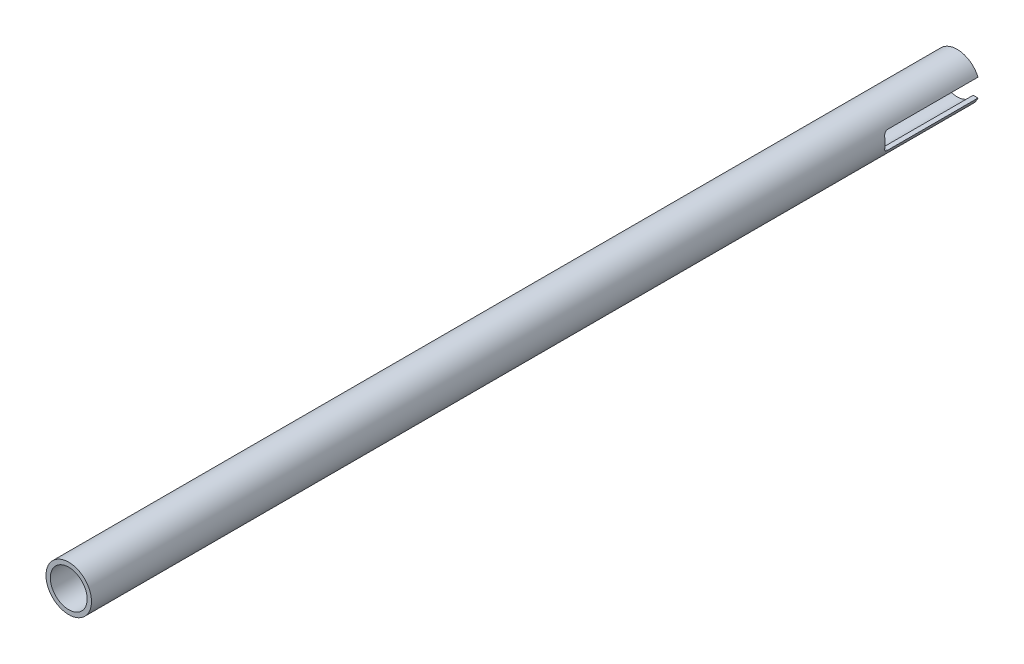
ISO-10303-21;
HEADER;
FILE_DESCRIPTION(('STEP AP214'),'2;1');
FILE_NAME('part.step','',(''),(''),'','','');
FILE_SCHEMA(('AUTOMOTIVE_DESIGN { 1 0 10303 214 1 1 1 1 }'));
ENDSEC;
DATA;
#1=APPLICATION_CONTEXT('core data for automotive mechanical design processes');
#2=APPLICATION_PROTOCOL_DEFINITION('international standard','automotive_design',2000,#1);
#3=PRODUCT_CONTEXT('',#1,'mechanical');
#4=PRODUCT('Part','Part','',(#3));
#5=PRODUCT_RELATED_PRODUCT_CATEGORY('part','',(#4));
#6=PRODUCT_DEFINITION_FORMATION('','',#4);
#7=PRODUCT_DEFINITION_CONTEXT('part definition',#1,'design');
#8=PRODUCT_DEFINITION('design','',#6,#7);
#9=PRODUCT_DEFINITION_SHAPE('','',#8);
#10=(LENGTH_UNIT() NAMED_UNIT(*) SI_UNIT(.MILLI.,.METRE.));
#11=(NAMED_UNIT(*) PLANE_ANGLE_UNIT() SI_UNIT($,.RADIAN.));
#12=(NAMED_UNIT(*) SI_UNIT($,.STERADIAN.) SOLID_ANGLE_UNIT());
#13=UNCERTAINTY_MEASURE_WITH_UNIT(LENGTH_MEASURE(1.E-05),#10,'distance_accuracy_value','');
#14=(GEOMETRIC_REPRESENTATION_CONTEXT(3) GLOBAL_UNCERTAINTY_ASSIGNED_CONTEXT((#13)) GLOBAL_UNIT_ASSIGNED_CONTEXT((#10,
#11,#12)) REPRESENTATION_CONTEXT('',''));
#15=CARTESIAN_POINT('',(0.,0.,0.));
#16=DIRECTION('',(0.,0.,1.));
#17=DIRECTION('',(1.,0.,0.));
#18=AXIS2_PLACEMENT_3D('',#15,#16,#17);
#19=CARTESIAN_POINT('',(0.,0.,0.));
#20=DIRECTION('',(0.,0.,1.));
#21=DIRECTION('',(1.,0.,0.));
#22=AXIS2_PLACEMENT_3D('',#19,#20,#21);
#23=PLANE('',#22);
#24=DIRECTION('',(-1.,0.,0.));
#25=VECTOR('',#24,1.);
#26=CARTESIAN_POINT('',(401.549427926421,-3.17500000000001,0.));
#27=LINE('',#26,#25);
#28=CARTESIAN_POINT('',(7.34407080575888,-3.17500000000001,0.));
#29=VERTEX_POINT('',#28);
#30=CARTESIAN_POINT('',(5.6454321358068,-3.17499999999999,0.));
#31=VERTEX_POINT('',#30);
#32=EDGE_CURVE('E57',#29,#31,#27,.T.);
#33=ORIENTED_EDGE('',*,*,#32,.F.);
#34=CARTESIAN_POINT('',(0.,0.,0.));
#35=DIRECTION('',(0.,0.,1.));
#36=DIRECTION('',(1.,0.,0.));
#37=AXIS2_PLACEMENT_3D('',#34,#35,#36);
#38=CIRCLE('',#37,8.001);
#39=CARTESIAN_POINT('',(-7.34407080575888,-3.17500000000001,0.));
#40=VERTEX_POINT('',#39);
#41=EDGE_CURVE('E146',#40,#29,#38,.T.);
#42=ORIENTED_EDGE('',*,*,#41,.F.);
#43=CARTESIAN_POINT('',(-5.64543213580682,-3.17500000000001,0.));
#44=VERTEX_POINT('',#43);
#45=EDGE_CURVE('E140',#44,#40,#27,.T.);
#46=ORIENTED_EDGE('',*,*,#45,.F.);
#47=CARTESIAN_POINT('',(0.,0.,0.));
#48=DIRECTION('',(0.,0.,1.));
#49=DIRECTION('',(1.,0.,0.));
#50=AXIS2_PLACEMENT_3D('',#47,#48,#49);
#51=CIRCLE('',#50,6.477);
#52=EDGE_CURVE('E242',#44,#31,#51,.T.);
#53=ORIENTED_EDGE('',*,*,#52,.T.);
#54=EDGE_LOOP('',(#33,#42,#46,#53));
#55=FACE_BOUND('',#54,.T.);
#56=ADVANCED_FACE('F33',(#55),#23,.F.);
#57=CARTESIAN_POINT('',(0.,0.,312.42));
#58=DIRECTION('',(0.,0.,-1.));
#59=DIRECTION('',(-1.,0.,0.));
#60=AXIS2_PLACEMENT_3D('',#57,#58,#59);
#61=CYLINDRICAL_SURFACE('',#60,8.001);
#62=CARTESIAN_POINT('',(0.,0.,312.42));
#63=DIRECTION('',(0.,0.,1.));
#64=DIRECTION('',(1.,0.,0.));
#65=AXIS2_PLACEMENT_3D('',#62,#63,#64);
#66=CIRCLE('',#65,8.001);
#67=CARTESIAN_POINT('',(8.001,0.,312.42));
#68=VERTEX_POINT('',#67);
#69=EDGE_CURVE('E249',#68,#68,#66,.T.);
#70=ORIENTED_EDGE('',*,*,#69,.F.);
#71=EDGE_LOOP('',(#70));
#72=FACE_BOUND('',#71,.T.);
#73=DIRECTION('',(0.,0.,-1.));
#74=VECTOR('',#73,1.);
#75=CARTESIAN_POINT('',(7.34407080575893,3.17499999999991,312.42));
#76=LINE('',#75,#74);
#77=CARTESIAN_POINT('',(7.34407080575894,3.175,0.));
#78=VERTEX_POINT('',#77);
#79=CARTESIAN_POINT('',(7.34407080575889,3.17499999999999,31.75));
#80=VERTEX_POINT('',#79);
#81=EDGE_CURVE('E238',#78,#80,#76,.F.);
#82=ORIENTED_EDGE('',*,*,#81,.F.);
#83=CARTESIAN_POINT('',(-7.34407080575894,3.175,0.));
#84=VERTEX_POINT('',#83);
#85=EDGE_CURVE('E253',#78,#84,#38,.T.);
#86=ORIENTED_EDGE('',*,*,#85,.T.);
#87=DIRECTION('',(0.,0.,-1.));
#88=VECTOR('',#87,1.);
#89=CARTESIAN_POINT('',(-7.34407080575893,3.17499999999991,312.42));
#90=LINE('',#89,#88);
#91=CARTESIAN_POINT('',(-7.34407080575889,3.17499999999999,31.75));
#92=VERTEX_POINT('',#91);
#93=EDGE_CURVE('E240',#92,#84,#90,.T.);
#94=ORIENTED_EDGE('',*,*,#93,.F.);
#95=CARTESIAN_POINT('',(-7.8288057837706,1.65099999999999,33.274));
#96=CARTESIAN_POINT('',(-7.81947795268345,1.69524181564514,33.2739996807889));
#97=CARTESIAN_POINT('',(-7.80977555287386,1.73937906238703,33.2720725755956));
#98=CARTESIAN_POINT('',(-7.7897053190962,1.82715995012294,33.2644259194222));
#99=CARTESIAN_POINT('',(-7.77933765259943,1.870803712116,33.2587073195399));
#100=CARTESIAN_POINT('',(-7.74740781787862,2.00038689143379,33.2359920832168));
#101=CARTESIAN_POINT('',(-7.72497172734663,2.08520038066885,33.2134353611242));
#102=CARTESIAN_POINT('',(-7.67879255624773,2.24931803273243,33.1543529357356));
#103=CARTESIAN_POINT('',(-7.65505009243317,2.32862475603218,33.117833776622));
#104=CARTESIAN_POINT('',(-7.60739952527334,2.47987144136614,33.0318403935313));
#105=CARTESIAN_POINT('',(-7.58349136309819,2.55180862700726,32.9823613118312));
#106=CARTESIAN_POINT('',(-7.53640113822511,2.68773877112478,32.8705553900397));
#107=CARTESIAN_POINT('',(-7.51324222932276,2.75155008701076,32.8079974672164));
#108=CARTESIAN_POINT('',(-7.46969556535498,2.86766507697724,32.6721080561482));
#109=CARTESIAN_POINT('',(-7.44930787514765,2.91996848174228,32.5987763158346));
#110=CARTESIAN_POINT('',(-7.41339882631975,3.00995182097469,32.445356056821));
#111=CARTESIAN_POINT('',(-7.39775949227146,3.04799299625043,32.365507568052));
#112=CARTESIAN_POINT('',(-7.37198636942666,3.10981595853761,32.1996963126839));
#113=CARTESIAN_POINT('',(-7.36184321814924,3.13362200161646,32.1137442276388));
#114=CARTESIAN_POINT('',(-7.35134082404798,3.15814271182933,31.980748149592));
#115=CARTESIAN_POINT('',(-7.34862226710174,3.16445643648463,31.9348527548858));
#116=CARTESIAN_POINT('',(-7.34498545577234,3.17288497032065,31.8426477775769));
#117=CARTESIAN_POINT('',(-7.34406565426136,3.17500338794749,31.7963385853611));
#118=CARTESIAN_POINT('',(-7.34407080575889,3.17499999999999,31.75));
#119=B_SPLINE_CURVE_WITH_KNOTS('',3,(#95,#96,#97,#98,#99,#100,#101,#102,#103,#104,#105,#106,
#107,#108,#109,#110,#111,#112,#113,#114,#115,#116,#117,#118),.UNSPECIFIED.,.F.,.F.,(4,2,2,2,2,2,
2,2,2,2,2,4),(0.,0.135553024626245,0.271072058592375,0.541437670457962,0.811676717226676,
1.08201720207601,1.35761362878683,1.63321650449497,1.90127196271359,2.16886935439238,
2.3078905012207,2.44679202186551),.UNSPECIFIED.);
#120=CARTESIAN_POINT('',(-7.8288057837706,1.65099999999999,33.274));
#121=VERTEX_POINT('',#120);
#122=EDGE_CURVE('E226',#121,#92,#119,.T.);
#123=ORIENTED_EDGE('',*,*,#122,.F.);
#124=CARTESIAN_POINT('',(0.,0.,33.274));
#125=DIRECTION('',(0.,0.,-1.));
#126=DIRECTION('',(-1.,0.,0.));
#127=AXIS2_PLACEMENT_3D('',#124,#125,#126);
#128=CIRCLE('',#127,8.001);
#129=CARTESIAN_POINT('',(-7.8288057837706,-1.65100000000001,33.274));
#130=VERTEX_POINT('',#129);
#131=EDGE_CURVE('E134',#130,#121,#128,.T.);
#132=ORIENTED_EDGE('',*,*,#131,.F.);
#133=CARTESIAN_POINT('',(-7.34407080575888,-3.175,31.75));
#134=CARTESIAN_POINT('',(-7.3440680096913,-3.17500157818638,31.7906984476088));
#135=CARTESIAN_POINT('',(-7.34477630214677,-3.17336860893187,31.8313759502433));
#136=CARTESIAN_POINT('',(-7.34758309143993,-3.16686635956913,31.912411407968));
#137=CARTESIAN_POINT('',(-7.34968118035477,-3.16199802907896,31.9527694533067));
#138=CARTESIAN_POINT('',(-7.35798857580184,-3.14264423927033,32.0726338560667));
#139=CARTESIAN_POINT('',(-7.36621159330718,-3.12340930879257,32.1512906881812));
#140=CARTESIAN_POINT('',(-7.38735918413182,-3.07305366060584,32.3038993996992));
#141=CARTESIAN_POINT('',(-7.40028060607282,-3.04194090905529,32.377854393813));
#142=CARTESIAN_POINT('',(-7.4298815779994,-2.96890708335138,32.5194453435949));
#143=CARTESIAN_POINT('',(-7.44656372650464,-2.92697853298673,32.5870768840646));
#144=CARTESIAN_POINT('',(-7.48338951433548,-2.83153727514408,32.7173193992745));
#145=CARTESIAN_POINT('',(-7.5036517696014,-2.77760154335605,32.7795861247467));
#146=CARTESIAN_POINT('',(-7.54586923311684,-2.66077336101833,32.8943978381578));
#147=CARTESIAN_POINT('',(-7.56782510086072,-2.59787741319581,32.9469390116058));
#148=CARTESIAN_POINT('',(-7.61377353576087,-2.46009532987571,33.04442490565));
#149=CARTESIAN_POINT('',(-7.63780327629239,-2.38468542927396,33.088613263246));
#150=CARTESIAN_POINT('',(-7.68517828309943,-2.22728162943213,33.1635295949975));
#151=CARTESIAN_POINT('',(-7.70852388215322,-2.14529100625114,33.1942642181981));
#152=CARTESIAN_POINT('',(-7.74866065435345,-1.99473307846589,33.2363269168587));
#153=CARTESIAN_POINT('',(-7.76579152458538,-1.9270088220366,33.2503889784846));
#154=CARTESIAN_POINT('',(-7.79853598216448,-1.78994063052703,33.2692336722557));
#155=CARTESIAN_POINT('',(-7.81414985826825,-1.7205970068191,33.2740180736839));
#156=CARTESIAN_POINT('',(-7.8288057837706,-1.65100000000001,33.274));
#157=B_SPLINE_CURVE_WITH_KNOTS('',3,(#133,#134,#135,#136,#137,#138,#139,#140,#141,#142,#143,
#144,#145,#146,#147,#148,#149,#150,#151,#152,#153,#154,#155,#156),.UNSPECIFIED.,.F.,.F.,(4,2,2,
2,2,2,2,2,2,2,2,4),(0.,0.122015614312961,0.243995431359561,0.486888996424005,0.729619944201783,
0.972519126749106,1.22593711832599,1.47945429417213,1.75015649231413,2.02072475374974,
2.23388433321154,2.44700325838136),.UNSPECIFIED.);
#158=CARTESIAN_POINT('',(-7.34407080575888,-3.175,31.75));
#159=VERTEX_POINT('',#158);
#160=EDGE_CURVE('E135',#159,#130,#157,.T.);
#161=ORIENTED_EDGE('',*,*,#160,.F.);
#162=DIRECTION('',(0.,0.,-1.));
#163=VECTOR('',#162,1.);
#164=CARTESIAN_POINT('',(-7.34407080575889,-3.17499999999999,312.42));
#165=LINE('',#164,#163);
#166=EDGE_CURVE('E147',#40,#159,#165,.F.);
#167=ORIENTED_EDGE('',*,*,#166,.F.);
#168=ORIENTED_EDGE('',*,*,#41,.T.);
#169=DIRECTION('',(0.,0.,-1.));
#170=VECTOR('',#169,1.);
#171=CARTESIAN_POINT('',(7.34407080575889,-3.17499999999999,312.42));
#172=LINE('',#171,#170);
#173=CARTESIAN_POINT('',(7.34407080575888,-3.175,31.75));
#174=VERTEX_POINT('',#173);
#175=EDGE_CURVE('E138',#174,#29,#172,.T.);
#176=ORIENTED_EDGE('',*,*,#175,.F.);
#177=CARTESIAN_POINT('',(7.8288057837706,-1.65100000000001,33.274));
#178=CARTESIAN_POINT('',(7.81947795268344,-1.69524181564516,33.2739996807889));
#179=CARTESIAN_POINT('',(7.80977555287386,-1.73937906238705,33.2720725755956));
#180=CARTESIAN_POINT('',(7.78970531909619,-1.82715995012295,33.2644259194222));
#181=CARTESIAN_POINT('',(7.77933765259943,-1.87080371211602,33.2587073195399));
#182=CARTESIAN_POINT('',(7.74740781787862,-2.00038689143381,33.2359920832168));
#183=CARTESIAN_POINT('',(7.72497172734662,-2.08520038066886,33.2134353611242));
#184=CARTESIAN_POINT('',(7.67879255624773,-2.24931803273245,33.1543529357356));
#185=CARTESIAN_POINT('',(7.65505009243317,-2.3286247560322,33.117833776622));
#186=CARTESIAN_POINT('',(7.60739952527334,-2.47987144136616,33.0318403935313));
#187=CARTESIAN_POINT('',(7.58349136309819,-2.55180862700728,32.9823613118312));
#188=CARTESIAN_POINT('',(7.5364011382251,-2.6877387711248,32.8705553900397));
#189=CARTESIAN_POINT('',(7.51324222932275,-2.75155008701078,32.8079974672164));
#190=CARTESIAN_POINT('',(7.46969556535497,-2.86766507697726,32.6721080561482));
#191=CARTESIAN_POINT('',(7.44930787514765,-2.9199684817423,32.5987763158346));
#192=CARTESIAN_POINT('',(7.41339882631974,-3.00995182097471,32.445356056821));
#193=CARTESIAN_POINT('',(7.39775949227145,-3.04799299625045,32.365507568052));
#194=CARTESIAN_POINT('',(7.37198636942665,-3.10981595853762,32.1996963126839));
#195=CARTESIAN_POINT('',(7.36184321814923,-3.13362200161647,32.1137442276388));
#196=CARTESIAN_POINT('',(7.35134082404797,-3.15814271182935,31.980748149592));
#197=CARTESIAN_POINT('',(7.34862226710173,-3.16445643648464,31.9348527548858));
#198=CARTESIAN_POINT('',(7.34498545577233,-3.17288497032067,31.8426477775769));
#199=CARTESIAN_POINT('',(7.34406565426135,-3.17500338794751,31.7963385853611));
#200=CARTESIAN_POINT('',(7.34407080575888,-3.175,31.75));
#201=B_SPLINE_CURVE_WITH_KNOTS('',3,(#177,#178,#179,#180,#181,#182,#183,#184,#185,#186,#187,
#188,#189,#190,#191,#192,#193,#194,#195,#196,#197,#198,#199,#200),.UNSPECIFIED.,.F.,.F.,(4,2,2,
2,2,2,2,2,2,2,2,4),(0.,0.135553024626244,0.271072058592371,0.541437670457961,0.811676717226673,
1.082017202076,1.35761362878683,1.63321650449497,1.90127196271358,2.16886935439238,
2.3078905012207,2.4467920218655),.UNSPECIFIED.);
#202=CARTESIAN_POINT('',(7.8288057837706,-1.65100000000001,33.274));
#203=VERTEX_POINT('',#202);
#204=EDGE_CURVE('E124',#203,#174,#201,.T.);
#205=ORIENTED_EDGE('',*,*,#204,.F.);
#206=CARTESIAN_POINT('',(7.8288057837706,1.65099999999999,33.274));
#207=VERTEX_POINT('',#206);
#208=EDGE_CURVE('E232',#207,#203,#128,.T.);
#209=ORIENTED_EDGE('',*,*,#208,.F.);
#210=CARTESIAN_POINT('',(7.34407080575889,3.17499999999999,31.75));
#211=CARTESIAN_POINT('',(7.34406800969131,3.17500157818637,31.7906984476088));
#212=CARTESIAN_POINT('',(7.34477630214678,3.17336860893185,31.8313759502433));
#213=CARTESIAN_POINT('',(7.34758309143993,3.16686635956911,31.912411407968));
#214=CARTESIAN_POINT('',(7.34968118035478,3.16199802907894,31.9527694533067));
#215=CARTESIAN_POINT('',(7.35798857580184,3.14264423927031,32.0726338560667));
#216=CARTESIAN_POINT('',(7.36621159330719,3.12340930879255,32.1512906881812));
#217=CARTESIAN_POINT('',(7.38735918413183,3.07305366060582,32.3038993996992));
#218=CARTESIAN_POINT('',(7.40028060607282,3.04194090905527,32.377854393813));
#219=CARTESIAN_POINT('',(7.42988157799941,2.96890708335136,32.5194453435949));
#220=CARTESIAN_POINT('',(7.44656372650465,2.92697853298671,32.5870768840646));
#221=CARTESIAN_POINT('',(7.48338951433549,2.83153727514406,32.7173193992745));
#222=CARTESIAN_POINT('',(7.50365176960141,2.77760154335604,32.7795861247467));
#223=CARTESIAN_POINT('',(7.54586923311685,2.66077336101832,32.8943978381578));
#224=CARTESIAN_POINT('',(7.56782510086072,2.59787741319579,32.9469390116058));
#225=CARTESIAN_POINT('',(7.61377353576087,2.4600953298757,33.04442490565));
#226=CARTESIAN_POINT('',(7.6378032762924,2.38468542927394,33.088613263246));
#227=CARTESIAN_POINT('',(7.68517828309944,2.22728162943211,33.1635295949975));
#228=CARTESIAN_POINT('',(7.70852388215323,2.14529100625112,33.1942642181981));
#229=CARTESIAN_POINT('',(7.74866065435345,1.99473307846586,33.2363269168587));
#230=CARTESIAN_POINT('',(7.76579152458538,1.92700882203658,33.2503889784846));
#231=CARTESIAN_POINT('',(7.79853598216448,1.78994063052701,33.2692336722557));
#232=CARTESIAN_POINT('',(7.81414985826825,1.72059700681908,33.2740180736839));
#233=CARTESIAN_POINT('',(7.8288057837706,1.65099999999999,33.274));
#234=B_SPLINE_CURVE_WITH_KNOTS('',3,(#210,#211,#212,#213,#214,#215,#216,#217,#218,#219,#220,
#221,#222,#223,#224,#225,#226,#227,#228,#229,#230,#231,#232,#233),.UNSPECIFIED.,.F.,.F.,(4,2,2,
2,2,2,2,2,2,2,2,4),(0.,0.122015614312961,0.243995431359561,0.486888996424005,0.729619944201783,
0.972519126749114,1.22593711832599,1.47945429417213,1.75015649231414,2.02072475374975,
2.23388433321155,2.44700325838137),.UNSPECIFIED.);
#235=EDGE_CURVE('E231',#80,#207,#234,.T.);
#236=ORIENTED_EDGE('',*,*,#235,.F.);
#237=EDGE_LOOP('',(#82,#86,#94,#123,#132,#161,#167,#168,#176,#205,#209,#236));
#238=FACE_BOUND('',#237,.T.);
#239=ADVANCED_FACE('F35',(#72,#238),#61,.T.);
#240=CARTESIAN_POINT('',(0.,0.,312.42));
#241=DIRECTION('',(0.,0.,-1.));
#242=DIRECTION('',(-1.,0.,0.));
#243=AXIS2_PLACEMENT_3D('',#240,#241,#242);
#244=CYLINDRICAL_SURFACE('',#243,6.477);
#245=CARTESIAN_POINT('',(0.,0.,312.42));
#246=DIRECTION('',(0.,0.,1.));
#247=DIRECTION('',(1.,0.,0.));
#248=AXIS2_PLACEMENT_3D('',#245,#246,#247);
#249=CIRCLE('',#248,6.477);
#250=CARTESIAN_POINT('',(6.477,0.,312.42));
#251=VERTEX_POINT('',#250);
#252=EDGE_CURVE('E243',#251,#251,#249,.T.);
#253=ORIENTED_EDGE('',*,*,#252,.T.);
#254=EDGE_LOOP('',(#253));
#255=FACE_BOUND('',#254,.T.);
#256=CARTESIAN_POINT('',(5.64543213580682,3.175,0.));
#257=VERTEX_POINT('',#256);
#258=CARTESIAN_POINT('',(-5.64543213580682,3.175,0.));
#259=VERTEX_POINT('',#258);
#260=EDGE_CURVE('E246',#257,#259,#51,.T.);
#261=ORIENTED_EDGE('',*,*,#260,.F.);
#262=DIRECTION('',(0.,0.,-1.));
#263=VECTOR('',#262,1.);
#264=CARTESIAN_POINT('',(5.64543213580684,3.17499999999991,312.42));
#265=LINE('',#264,#263);
#266=CARTESIAN_POINT('',(5.64543213580679,3.17499999999999,31.75));
#267=VERTEX_POINT('',#266);
#268=EDGE_CURVE('E11',#257,#267,#265,.F.);
#269=ORIENTED_EDGE('',*,*,#268,.T.);
#270=CARTESIAN_POINT('',(5.6454321358068,3.17499999999999,31.75));
#271=CARTESIAN_POINT('',(5.64542798532432,3.1750025301249,31.7895022750384));
#272=CARTESIAN_POINT('',(5.64629676751123,3.17346305780188,31.8289831851797));
#273=CARTESIAN_POINT('',(5.64973489172762,3.16734010596933,31.907616333837));
#274=CARTESIAN_POINT('',(5.65230347216193,3.16275798971433,31.9467687115998));
#275=CARTESIAN_POINT('',(5.66245282356231,3.14457608288718,32.0629070155873));
#276=CARTESIAN_POINT('',(5.67247830845162,3.1265396508718,32.1390381879893));
#277=CARTESIAN_POINT('',(5.69814957474155,3.07950075965754,32.2866255007952));
#278=CARTESIAN_POINT('',(5.71378770060105,3.05051323473277,32.3580878532046));
#279=CARTESIAN_POINT('',(5.74949312759986,2.98267072120713,32.4950337996201));
#280=CARTESIAN_POINT('',(5.7695654342793,2.94380457356395,32.5605105176722));
#281=CARTESIAN_POINT('',(5.81427344287328,2.85454020484128,32.6883725064171));
#282=CARTESIAN_POINT('',(5.83912294015509,2.80355001313473,32.7502682413202));
#283=CARTESIAN_POINT('',(5.89090094280743,2.69305400468479,32.8649190340714));
#284=CARTESIAN_POINT('',(5.91783040535228,2.63354425646504,32.9176698468731));
#285=CARTESIAN_POINT('',(5.9754026920417,2.50037980782341,33.0183991647787));
#286=CARTESIAN_POINT('',(6.00613015030678,2.42589024924425,33.0652294493506));
#287=CARTESIAN_POINT('',(6.06685054178971,2.26977298542591,33.1454912659983));
#288=CARTESIAN_POINT('',(6.09684379767184,2.18814849062352,33.1789287868608));
#289=CARTESIAN_POINT('',(6.15068954263711,2.0313545212819,33.2277262918858));
#290=CARTESIAN_POINT('',(6.17481721444706,1.95685658409067,33.2449485076857));
#291=CARTESIAN_POINT('',(6.2208090046563,1.80539896583251,33.2681012531514));
#292=CARTESIAN_POINT('',(6.24267154884635,1.72843762073706,33.2740239790673));
#293=CARTESIAN_POINT('',(6.26304462701648,1.65099999999999,33.274));
#294=B_SPLINE_CURVE_WITH_KNOTS('',3,(#270,#271,#272,#273,#274,#275,#276,#277,#278,#279,#280,
#281,#282,#283,#284,#285,#286,#287,#288,#289,#290,#291,#292,#293),.UNSPECIFIED.,.F.,.F.,(4,2,2,
2,2,2,2,2,2,2,2,4),(0.,0.118426117882553,0.236799210795268,0.472172634307253,0.707226225252078,
0.942546525606806,1.19340365391803,1.44437691938388,1.72272641785956,2.0009513086068,
2.2406452178067,2.48050460661625),.UNSPECIFIED.);
#295=CARTESIAN_POINT('',(6.26304462701648,1.65099999999999,33.274));
#296=VERTEX_POINT('',#295);
#297=EDGE_CURVE('E42',#267,#296,#294,.T.);
#298=ORIENTED_EDGE('',*,*,#297,.T.);
#299=CARTESIAN_POINT('',(0.,0.,33.274));
#300=DIRECTION('',(0.,0.,-1.));
#301=DIRECTION('',(-1.,0.,0.));
#302=AXIS2_PLACEMENT_3D('',#299,#300,#301);
#303=CIRCLE('',#302,6.477);
#304=CARTESIAN_POINT('',(6.26304462701648,-1.65100000000001,33.274));
#305=VERTEX_POINT('',#304);
#306=EDGE_CURVE('E189',#296,#305,#303,.T.);
#307=ORIENTED_EDGE('',*,*,#306,.T.);
#308=CARTESIAN_POINT('',(6.26304462701648,-1.65100000000001,33.274));
#309=CARTESIAN_POINT('',(6.25119301356599,-1.69597019045452,33.2739996512926));
#310=CARTESIAN_POINT('',(6.23885805015263,-1.74078424361484,33.2720087653986));
#311=CARTESIAN_POINT('',(6.21333080831812,-1.82980515275706,33.264134138941));
#312=CARTESIAN_POINT('',(6.20013884930389,-1.87401222760585,33.2582518413062));
#313=CARTESIAN_POINT('',(6.15951133396886,-2.00506101361784,33.2349457970163));
#314=CARTESIAN_POINT('',(6.13094979172369,-2.09061085165535,33.2118617467996));
#315=CARTESIAN_POINT('',(6.07212151471613,-2.25578612168244,33.1516219603263));
#316=CARTESIAN_POINT('',(6.04185654214358,-2.33541748531392,33.1144805465843));
#317=CARTESIAN_POINT('',(5.98100165398782,-2.48713337520254,33.0271532445204));
#318=CARTESIAN_POINT('',(5.95041151302896,-2.55921223237762,32.9769576544588));
#319=CARTESIAN_POINT('',(5.88959770370069,-2.69629003214929,32.8627307014112));
#320=CARTESIAN_POINT('',(5.85942026108732,-2.76097278644595,32.7982938275107));
#321=CARTESIAN_POINT('',(5.80262181829034,-2.87843237174363,32.6579375307773));
#322=CARTESIAN_POINT('',(5.77600068690932,-2.93120964200445,32.5820185317567));
#323=CARTESIAN_POINT('',(5.72961508062245,-3.02084256755071,32.4238173863488));
#324=CARTESIAN_POINT('',(5.70961192114585,-3.05826802843451,32.3419300118511));
#325=CARTESIAN_POINT('',(5.67705818777086,-3.11828924116529,32.1715909438744));
#326=CARTESIAN_POINT('',(5.66448853762436,-3.14092296814996,32.0831567140417));
#327=CARTESIAN_POINT('',(5.65274801817815,-3.16196375608022,31.953042864781));
#328=CARTESIAN_POINT('',(5.65001234622036,-3.16684526064363,31.9126313476031));
#329=CARTESIAN_POINT('',(5.64635324825543,-3.17336296637714,31.8314890576694));
#330=CARTESIAN_POINT('',(5.64542881846813,-3.17500096508517,31.790758474312));
#331=CARTESIAN_POINT('',(5.64543213580679,-3.175,31.75));
#332=B_SPLINE_CURVE_WITH_KNOTS('',3,(#308,#309,#310,#311,#312,#313,#314,#315,#316,#317,#318,
#319,#320,#321,#322,#323,#324,#325,#326,#327,#328,#329,#330,#331),.UNSPECIFIED.,.F.,.F.,(4,2,2,
2,2,2,2,2,2,2,2,4),(0.,0.139419976741779,0.278788285754547,0.556665652257203,0.834260658887697,
1.11206256399923,1.3991269523371,1.6861807475333,1.9613229485987,2.23575596690122,
2.35800176569004,2.48017979736539),.UNSPECIFIED.);
#333=CARTESIAN_POINT('',(5.64543213580682,-3.175,31.75));
#334=VERTEX_POINT('',#333);
#335=EDGE_CURVE('E183',#305,#334,#332,.T.);
#336=ORIENTED_EDGE('',*,*,#335,.T.);
#337=DIRECTION('',(0.,0.,-1.));
#338=VECTOR('',#337,1.);
#339=CARTESIAN_POINT('',(5.64543213580679,-3.17499999999999,312.42));
#340=LINE('',#339,#338);
#341=EDGE_CURVE('E139',#334,#31,#340,.T.);
#342=ORIENTED_EDGE('',*,*,#341,.T.);
#343=ORIENTED_EDGE('',*,*,#52,.F.);
#344=DIRECTION('',(0.,0.,-1.));
#345=VECTOR('',#344,1.);
#346=CARTESIAN_POINT('',(-5.64543213580679,-3.17499999999999,312.42));
#347=LINE('',#346,#345);
#348=CARTESIAN_POINT('',(-5.64543213580679,-3.17499999999999,31.75));
#349=VERTEX_POINT('',#348);
#350=EDGE_CURVE('E252',#44,#349,#347,.F.);
#351=ORIENTED_EDGE('',*,*,#350,.T.);
#352=CARTESIAN_POINT('',(-5.64543213580679,-3.175,31.75));
#353=CARTESIAN_POINT('',(-5.64542798532432,-3.17500253012492,31.7895022750384));
#354=CARTESIAN_POINT('',(-5.64629676751122,-3.17346305780189,31.8289831851797));
#355=CARTESIAN_POINT('',(-5.64973489172761,-3.16734010596935,31.907616333837));
#356=CARTESIAN_POINT('',(-5.65230347216192,-3.16275798971435,31.9467687115998));
#357=CARTESIAN_POINT('',(-5.6624528235623,-3.1445760828872,32.0629070155873));
#358=CARTESIAN_POINT('',(-5.67247830845161,-3.12653965087182,32.1390381879893));
#359=CARTESIAN_POINT('',(-5.69814957474154,-3.07950075965756,32.2866255007952));
#360=CARTESIAN_POINT('',(-5.71378770060104,-3.05051323473279,32.3580878532046));
#361=CARTESIAN_POINT('',(-5.74949312759985,-2.98267072120715,32.4950337996201));
#362=CARTESIAN_POINT('',(-5.76956543427929,-2.94380457356397,32.5605105176722));
#363=CARTESIAN_POINT('',(-5.81427344287327,-2.85454020484131,32.6883725064171));
#364=CARTESIAN_POINT('',(-5.83912294015508,-2.80355001313475,32.7502682413202));
#365=CARTESIAN_POINT('',(-5.89090094280742,-2.69305400468481,32.8649190340714));
#366=CARTESIAN_POINT('',(-5.91783040535227,-2.63354425646506,32.9176698468731));
#367=CARTESIAN_POINT('',(-5.97540269204169,-2.50037980782343,33.0183991647787));
#368=CARTESIAN_POINT('',(-6.00613015030677,-2.42589024924428,33.0652294493506));
#369=CARTESIAN_POINT('',(-6.0668505417897,-2.26977298542594,33.1454912659983));
#370=CARTESIAN_POINT('',(-6.09684379767183,-2.18814849062355,33.1789287868608));
#371=CARTESIAN_POINT('',(-6.1506895426371,-2.03135452128193,33.2277262918858));
#372=CARTESIAN_POINT('',(-6.17481721444705,-1.9568565840907,33.2449485076857));
#373=CARTESIAN_POINT('',(-6.22080900465629,-1.80539896583254,33.2681012531514));
#374=CARTESIAN_POINT('',(-6.24267154884634,-1.72843762073708,33.2740239790673));
#375=CARTESIAN_POINT('',(-6.26304462701648,-1.65100000000001,33.274));
#376=B_SPLINE_CURVE_WITH_KNOTS('',3,(#352,#353,#354,#355,#356,#357,#358,#359,#360,#361,#362,
#363,#364,#365,#366,#367,#368,#369,#370,#371,#372,#373,#374,#375),.UNSPECIFIED.,.F.,.F.,(4,2,2,
2,2,2,2,2,2,2,2,4),(0.,0.118426117882546,0.236799210795261,0.472172634307245,0.707226225252078,
0.942546525606797,1.19340365391802,1.44437691938387,1.72272641785954,2.00095130860679,
2.24064521780669,2.48050460661625),.UNSPECIFIED.);
#377=CARTESIAN_POINT('',(-6.26304462701648,-1.65100000000001,33.274));
#378=VERTEX_POINT('',#377);
#379=EDGE_CURVE('E173',#349,#378,#376,.T.);
#380=ORIENTED_EDGE('',*,*,#379,.T.);
#381=CARTESIAN_POINT('',(-6.26304462701648,1.65099999999999,33.274));
#382=VERTEX_POINT('',#381);
#383=EDGE_CURVE('E214',#378,#382,#303,.T.);
#384=ORIENTED_EDGE('',*,*,#383,.T.);
#385=CARTESIAN_POINT('',(-6.26304462701648,1.65099999999999,33.274));
#386=CARTESIAN_POINT('',(-6.25119301356599,1.6959701904545,33.2739996512926));
#387=CARTESIAN_POINT('',(-6.23885805015264,1.74078424361482,33.2720087653986));
#388=CARTESIAN_POINT('',(-6.21333080831813,1.82980515275704,33.264134138941));
#389=CARTESIAN_POINT('',(-6.20013884930389,1.87401222760583,33.2582518413062));
#390=CARTESIAN_POINT('',(-6.15951133396887,2.00506101361782,33.2349457970163));
#391=CARTESIAN_POINT('',(-6.1309497917237,2.09061085165533,33.2118617467996));
#392=CARTESIAN_POINT('',(-6.07212151471614,2.25578612168242,33.1516219603263));
#393=CARTESIAN_POINT('',(-6.04185654214358,2.3354174853139,33.1144805465843));
#394=CARTESIAN_POINT('',(-5.98100165398783,2.48713337520252,33.0271532445204));
#395=CARTESIAN_POINT('',(-5.95041151302897,2.5592122323776,32.9769576544588));
#396=CARTESIAN_POINT('',(-5.8895977037007,2.69629003214927,32.8627307014112));
#397=CARTESIAN_POINT('',(-5.85942026108733,2.76097278644594,32.7982938275107));
#398=CARTESIAN_POINT('',(-5.80262181829035,2.87843237174361,32.6579375307773));
#399=CARTESIAN_POINT('',(-5.77600068690933,2.93120964200443,32.5820185317567));
#400=CARTESIAN_POINT('',(-5.72961508062246,3.02084256755069,32.4238173863488));
#401=CARTESIAN_POINT('',(-5.70961192114586,3.0582680284345,32.3419300118511));
#402=CARTESIAN_POINT('',(-5.67705818777087,3.11828924116527,32.1715909438744));
#403=CARTESIAN_POINT('',(-5.66448853762437,3.14092296814994,32.0831567140417));
#404=CARTESIAN_POINT('',(-5.65274801817816,3.1619637560802,31.953042864781));
#405=CARTESIAN_POINT('',(-5.65001234622037,3.16684526064361,31.9126313476031));
#406=CARTESIAN_POINT('',(-5.64635324825544,3.17336296637712,31.8314890576694));
#407=CARTESIAN_POINT('',(-5.64542881846814,3.17500096508515,31.790758474312));
#408=CARTESIAN_POINT('',(-5.6454321358068,3.17499999999999,31.75));
#409=B_SPLINE_CURVE_WITH_KNOTS('',3,(#385,#386,#387,#388,#389,#390,#391,#392,#393,#394,#395,
#396,#397,#398,#399,#400,#401,#402,#403,#404,#405,#406,#407,#408),.UNSPECIFIED.,.F.,.F.,(4,2,2,
2,2,2,2,2,2,2,2,4),(0.,0.139419976741779,0.278788285754548,0.556665652257205,0.834260658887702,
1.11206256399923,1.39912695233711,1.68618074753331,1.9613229485987,2.23575596690122,
2.35800176569004,2.4801797973654),.UNSPECIFIED.);
#410=CARTESIAN_POINT('',(-5.64543213580679,3.17499999999999,31.75));
#411=VERTEX_POINT('',#410);
#412=EDGE_CURVE('E207',#382,#411,#409,.T.);
#413=ORIENTED_EDGE('',*,*,#412,.T.);
#414=DIRECTION('',(0.,0.,-1.));
#415=VECTOR('',#414,1.);
#416=CARTESIAN_POINT('',(-5.64543213580684,3.17499999999991,312.42));
#417=LINE('',#416,#415);
#418=EDGE_CURVE('E213',#411,#259,#417,.T.);
#419=ORIENTED_EDGE('',*,*,#418,.T.);
#420=EDGE_LOOP('',(#261,#269,#298,#307,#336,#342,#343,#351,#380,#384,#413,#419));
#421=FACE_BOUND('',#420,.T.);
#422=ADVANCED_FACE('F195',(#255,#421),#244,.F.);
#423=CARTESIAN_POINT('',(0.,0.,312.42));
#424=DIRECTION('',(0.,0.,1.));
#425=DIRECTION('',(1.,0.,0.));
#426=AXIS2_PLACEMENT_3D('',#423,#424,#425);
#427=PLANE('',#426);
#428=ORIENTED_EDGE('',*,*,#69,.T.);
#429=EDGE_LOOP('',(#428));
#430=FACE_BOUND('',#429,.T.);
#431=ORIENTED_EDGE('',*,*,#252,.F.);
#432=EDGE_LOOP('',(#431));
#433=FACE_BOUND('',#432,.T.);
#434=ADVANCED_FACE('F200',(#430,#433),#427,.T.);
#435=ORIENTED_EDGE('',*,*,#85,.F.);
#436=DIRECTION('',(-1.,0.,0.));
#437=VECTOR('',#436,1.);
#438=CARTESIAN_POINT('',(401.549427926421,3.175,0.));
#439=LINE('',#438,#437);
#440=EDGE_CURVE('E150',#78,#257,#439,.T.);
#441=ORIENTED_EDGE('',*,*,#440,.T.);
#442=ORIENTED_EDGE('',*,*,#260,.T.);
#443=EDGE_CURVE('E272',#259,#84,#439,.T.);
#444=ORIENTED_EDGE('',*,*,#443,.T.);
#445=EDGE_LOOP('',(#435,#441,#442,#444));
#446=FACE_BOUND('',#445,.T.);
#447=ADVANCED_FACE('F295',(#446),#23,.F.);
#448=CARTESIAN_POINT('',(401.549427926421,-3.175,31.75));
#449=DIRECTION('',(0.,1.,0.));
#450=DIRECTION('',(0.,0.,1.));
#451=AXIS2_PLACEMENT_3D('',#448,#449,#450);
#452=PLANE('',#451);
#453=ORIENTED_EDGE('',*,*,#45,.T.);
#454=ORIENTED_EDGE('',*,*,#166,.T.);
#455=DIRECTION('',(-1.,0.,0.));
#456=VECTOR('',#455,1.);
#457=CARTESIAN_POINT('',(401.549427926421,-3.175,31.75));
#458=LINE('',#457,#456);
#459=EDGE_CURVE('E49',#349,#159,#458,.T.);
#460=ORIENTED_EDGE('',*,*,#459,.F.);
#461=ORIENTED_EDGE('',*,*,#350,.F.);
#462=EDGE_LOOP('',(#453,#454,#460,#461));
#463=FACE_BOUND('',#462,.T.);
#464=ADVANCED_FACE('F285',(#463),#452,.T.);
#465=CARTESIAN_POINT('',(401.549427926421,-1.65100000000001,31.75));
#466=DIRECTION('',(-1.,0.,0.));
#467=DIRECTION('',(0.,0.,1.));
#468=AXIS2_PLACEMENT_3D('',#465,#466,#467);
#469=CYLINDRICAL_SURFACE('',#468,1.524);
#470=ORIENTED_EDGE('',*,*,#459,.T.);
#471=ORIENTED_EDGE('',*,*,#160,.T.);
#472=DIRECTION('',(-1.,0.,0.));
#473=VECTOR('',#472,1.);
#474=CARTESIAN_POINT('',(401.549427926421,-1.65100000000001,33.274));
#475=LINE('',#474,#473);
#476=EDGE_CURVE('E281',#378,#130,#475,.T.);
#477=ORIENTED_EDGE('',*,*,#476,.F.);
#478=ORIENTED_EDGE('',*,*,#379,.F.);
#479=EDGE_LOOP('',(#470,#471,#477,#478));
#480=FACE_BOUND('',#479,.T.);
#481=ADVANCED_FACE('F168',(#480),#469,.F.);
#482=CARTESIAN_POINT('',(401.549427926421,1.65099999999999,33.274));
#483=DIRECTION('',(0.,0.,-1.));
#484=DIRECTION('',(-1.,0.,0.));
#485=AXIS2_PLACEMENT_3D('',#482,#483,#484);
#486=PLANE('',#485);
#487=ORIENTED_EDGE('',*,*,#476,.T.);
#488=ORIENTED_EDGE('',*,*,#131,.T.);
#489=DIRECTION('',(-1.,0.,0.));
#490=VECTOR('',#489,1.);
#491=CARTESIAN_POINT('',(401.549427926421,1.65099999999999,33.274));
#492=LINE('',#491,#490);
#493=EDGE_CURVE('E278',#382,#121,#492,.T.);
#494=ORIENTED_EDGE('',*,*,#493,.F.);
#495=ORIENTED_EDGE('',*,*,#383,.F.);
#496=EDGE_LOOP('',(#487,#488,#494,#495));
#497=FACE_BOUND('',#496,.T.);
#498=ADVANCED_FACE('F300',(#497),#486,.T.);
#499=CARTESIAN_POINT('',(401.549427926421,1.65099999999999,31.75));
#500=DIRECTION('',(-1.,0.,0.));
#501=DIRECTION('',(0.,0.,1.));
#502=AXIS2_PLACEMENT_3D('',#499,#500,#501);
#503=CYLINDRICAL_SURFACE('',#502,1.524);
#504=ORIENTED_EDGE('',*,*,#493,.T.);
#505=ORIENTED_EDGE('',*,*,#122,.T.);
#506=DIRECTION('',(-1.,0.,0.));
#507=VECTOR('',#506,1.);
#508=CARTESIAN_POINT('',(401.549427926421,3.17499999999999,31.75));
#509=LINE('',#508,#507);
#510=EDGE_CURVE('E273',#411,#92,#509,.T.);
#511=ORIENTED_EDGE('',*,*,#510,.F.);
#512=ORIENTED_EDGE('',*,*,#412,.F.);
#513=EDGE_LOOP('',(#504,#505,#511,#512));
#514=FACE_BOUND('',#513,.T.);
#515=ADVANCED_FACE('F220',(#514),#503,.F.);
#516=CARTESIAN_POINT('',(401.549427926421,3.175,0.));
#517=DIRECTION('',(0.,-1.,0.));
#518=DIRECTION('',(0.,0.,-1.));
#519=AXIS2_PLACEMENT_3D('',#516,#517,#518);
#520=PLANE('',#519);
#521=ORIENTED_EDGE('',*,*,#510,.T.);
#522=ORIENTED_EDGE('',*,*,#93,.T.);
#523=ORIENTED_EDGE('',*,*,#443,.F.);
#524=ORIENTED_EDGE('',*,*,#418,.F.);
#525=EDGE_LOOP('',(#521,#522,#523,#524));
#526=FACE_BOUND('',#525,.T.);
#527=ADVANCED_FACE('F202',(#526),#520,.T.);
#528=ORIENTED_EDGE('',*,*,#440,.F.);
#529=ORIENTED_EDGE('',*,*,#81,.T.);
#530=EDGE_CURVE('E266',#80,#267,#509,.T.);
#531=ORIENTED_EDGE('',*,*,#530,.T.);
#532=ORIENTED_EDGE('',*,*,#268,.F.);
#533=EDGE_LOOP('',(#528,#529,#531,#532));
#534=FACE_BOUND('',#533,.T.);
#535=ADVANCED_FACE('F218',(#534),#520,.T.);
#536=ORIENTED_EDGE('',*,*,#530,.F.);
#537=ORIENTED_EDGE('',*,*,#235,.T.);
#538=EDGE_CURVE('E269',#207,#296,#492,.T.);
#539=ORIENTED_EDGE('',*,*,#538,.T.);
#540=ORIENTED_EDGE('',*,*,#297,.F.);
#541=EDGE_LOOP('',(#536,#537,#539,#540));
#542=FACE_BOUND('',#541,.T.);
#543=ADVANCED_FACE('F215',(#542),#503,.F.);
#544=ORIENTED_EDGE('',*,*,#538,.F.);
#545=ORIENTED_EDGE('',*,*,#208,.T.);
#546=EDGE_CURVE('E130',#203,#305,#475,.T.);
#547=ORIENTED_EDGE('',*,*,#546,.T.);
#548=ORIENTED_EDGE('',*,*,#306,.F.);
#549=EDGE_LOOP('',(#544,#545,#547,#548));
#550=FACE_BOUND('',#549,.T.);
#551=ADVANCED_FACE('F167',(#550),#486,.T.);
#552=ORIENTED_EDGE('',*,*,#546,.F.);
#553=ORIENTED_EDGE('',*,*,#204,.T.);
#554=EDGE_CURVE('E127',#174,#334,#458,.T.);
#555=ORIENTED_EDGE('',*,*,#554,.T.);
#556=ORIENTED_EDGE('',*,*,#335,.F.);
#557=EDGE_LOOP('',(#552,#553,#555,#556));
#558=FACE_BOUND('',#557,.T.);
#559=ADVANCED_FACE('F126',(#558),#469,.F.);
#560=ORIENTED_EDGE('',*,*,#554,.F.);
#561=ORIENTED_EDGE('',*,*,#175,.T.);
#562=ORIENTED_EDGE('',*,*,#32,.T.);
#563=ORIENTED_EDGE('',*,*,#341,.F.);
#564=EDGE_LOOP('',(#560,#561,#562,#563));
#565=FACE_BOUND('',#564,.T.);
#566=ADVANCED_FACE('F137',(#565),#452,.T.);
#567=CLOSED_SHELL('',(#56,#239,#422,#434,#447,#464,#481,#498,#515,#527,#535,#543,#551,#559,#566));
#568=MANIFOLD_SOLID_BREP('B2',#567);
#569=ADVANCED_BREP_SHAPE_REPRESENTATION('',(#18,#568),#14);
#570=SHAPE_DEFINITION_REPRESENTATION(#9,#569);
ENDSEC;
END-ISO-10303-21;
